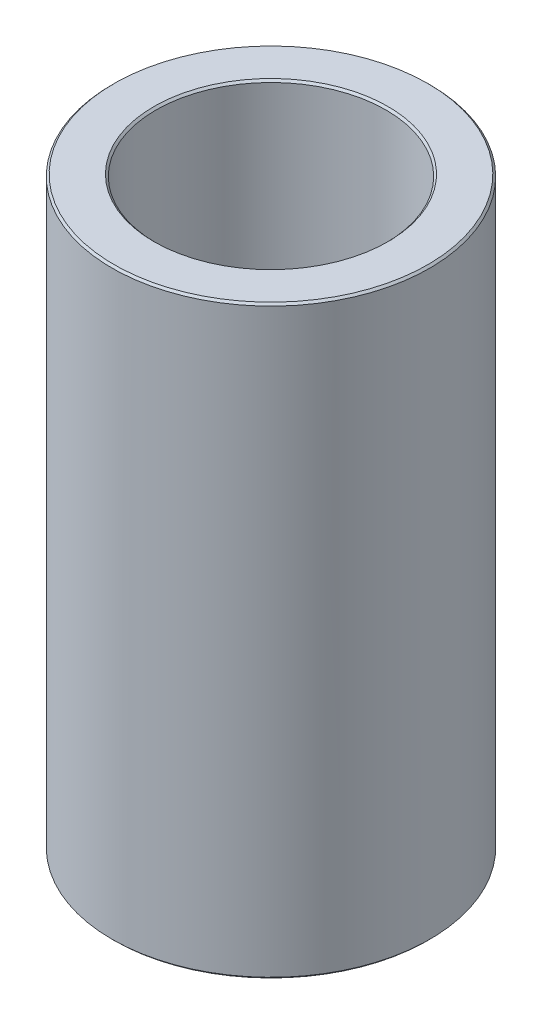
ISO-10303-21;
HEADER;
FILE_DESCRIPTION(('STEP AP214'),'2;1');
FILE_NAME('part.step','',(''),(''),'','','');
FILE_SCHEMA(('AUTOMOTIVE_DESIGN { 1 0 10303 214 1 1 1 1 }'));
ENDSEC;
DATA;
#1=APPLICATION_CONTEXT('core data for automotive mechanical design processes');
#2=APPLICATION_PROTOCOL_DEFINITION('international standard','automotive_design',2000,#1);
#3=PRODUCT_CONTEXT('',#1,'mechanical');
#4=PRODUCT('Part','Part','',(#3));
#5=PRODUCT_RELATED_PRODUCT_CATEGORY('part','',(#4));
#6=PRODUCT_DEFINITION_FORMATION('','',#4);
#7=PRODUCT_DEFINITION_CONTEXT('part definition',#1,'design');
#8=PRODUCT_DEFINITION('design','',#6,#7);
#9=PRODUCT_DEFINITION_SHAPE('','',#8);
#10=(LENGTH_UNIT() NAMED_UNIT(*) SI_UNIT(.MILLI.,.METRE.));
#11=(NAMED_UNIT(*) PLANE_ANGLE_UNIT() SI_UNIT($,.RADIAN.));
#12=(NAMED_UNIT(*) SI_UNIT($,.STERADIAN.) SOLID_ANGLE_UNIT());
#13=UNCERTAINTY_MEASURE_WITH_UNIT(LENGTH_MEASURE(1.E-05),#10,'distance_accuracy_value','');
#14=(GEOMETRIC_REPRESENTATION_CONTEXT(3) GLOBAL_UNCERTAINTY_ASSIGNED_CONTEXT((#13)) GLOBAL_UNIT_ASSIGNED_CONTEXT((#10,
#11,#12)) REPRESENTATION_CONTEXT('',''));
#15=CARTESIAN_POINT('',(0.,0.,0.));
#16=DIRECTION('',(0.,0.,1.));
#17=DIRECTION('',(1.,0.,0.));
#18=AXIS2_PLACEMENT_3D('',#15,#16,#17);
#19=CARTESIAN_POINT('',(0.,211.796028497552,0.));
#20=DIRECTION('',(0.,-1.,0.));
#21=DIRECTION('',(0.,0.,-1.));
#22=AXIS2_PLACEMENT_3D('',#19,#20,#21);
#23=CYLINDRICAL_SURFACE('',#22,57.5);
#24=CARTESIAN_POINT('',(0.,0.728195884436761,0.));
#25=DIRECTION('',(0.,1.,0.));
#26=DIRECTION('',(0.,0.,1.));
#27=AXIS2_PLACEMENT_3D('',#24,#25,#26);
#28=CIRCLE('',#27,57.5);
#29=CARTESIAN_POINT('',(0.,0.728195884436761,57.5));
#30=VERTEX_POINT('',#29);
#31=EDGE_CURVE('E10',#30,#30,#28,.T.);
#32=ORIENTED_EDGE('',*,*,#31,.T.);
#33=EDGE_LOOP('',(#32));
#34=FACE_BOUND('',#33,.T.);
#35=CARTESIAN_POINT('',(0.,211.067832613115,0.));
#36=DIRECTION('',(0.,1.,0.));
#37=DIRECTION('',(0.,0.,1.));
#38=AXIS2_PLACEMENT_3D('',#35,#36,#37);
#39=CIRCLE('',#38,57.5);
#40=CARTESIAN_POINT('',(0.,211.067832613115,-57.5));
#41=VERTEX_POINT('',#40);
#42=EDGE_CURVE('E50',#41,#41,#39,.F.);
#43=ORIENTED_EDGE('',*,*,#42,.T.);
#44=EDGE_LOOP('',(#43));
#45=FACE_BOUND('',#44,.T.);
#46=ADVANCED_FACE('F39',(#34,#45),#23,.T.);
#47=CARTESIAN_POINT('',(0.,211.796028497552,0.));
#48=DIRECTION('',(0.,1.,0.));
#49=DIRECTION('',(0.,0.,1.));
#50=AXIS2_PLACEMENT_3D('',#47,#48,#49);
#51=PLANE('',#50);
#52=CARTESIAN_POINT('',(0.,211.796028497552,0.));
#53=DIRECTION('',(0.,1.,0.));
#54=DIRECTION('',(0.,0.,1.));
#55=AXIS2_PLACEMENT_3D('',#52,#53,#54);
#56=CIRCLE('',#55,42.366535014007);
#57=CARTESIAN_POINT('',(0.,211.796028497552,42.366535014007));
#58=VERTEX_POINT('',#57);
#59=EDGE_CURVE('E58',#58,#58,#56,.F.);
#60=ORIENTED_EDGE('',*,*,#59,.T.);
#61=EDGE_LOOP('',(#60));
#62=FACE_BOUND('',#61,.T.);
#63=CARTESIAN_POINT('',(0.,211.796028497552,0.));
#64=DIRECTION('',(0.,1.,0.));
#65=DIRECTION('',(0.,0.,1.));
#66=AXIS2_PLACEMENT_3D('',#63,#64,#65);
#67=CIRCLE('',#66,56.7718041155632);
#68=CARTESIAN_POINT('',(0.,211.796028497552,-56.7718041155632));
#69=VERTEX_POINT('',#68);
#70=EDGE_CURVE('E61',#69,#69,#67,.T.);
#71=ORIENTED_EDGE('',*,*,#70,.T.);
#72=EDGE_LOOP('',(#71));
#73=FACE_BOUND('',#72,.T.);
#74=ADVANCED_FACE('F88',(#62,#73),#51,.T.);
#75=CARTESIAN_POINT('',(0.,0.,0.));
#76=DIRECTION('',(0.,1.,0.));
#77=DIRECTION('',(0.,0.,1.));
#78=AXIS2_PLACEMENT_3D('',#75,#76,#77);
#79=PLANE('',#78);
#80=CARTESIAN_POINT('',(0.,0.,0.));
#81=DIRECTION('',(0.,1.,0.));
#82=DIRECTION('',(0.,0.,1.));
#83=AXIS2_PLACEMENT_3D('',#80,#81,#82);
#84=CIRCLE('',#83,42.366535014007);
#85=CARTESIAN_POINT('',(0.,0.,-42.366535014007));
#86=VERTEX_POINT('',#85);
#87=EDGE_CURVE('E51',#86,#86,#84,.T.);
#88=ORIENTED_EDGE('',*,*,#87,.T.);
#89=EDGE_LOOP('',(#88));
#90=FACE_BOUND('',#89,.T.);
#91=CARTESIAN_POINT('',(0.,0.,0.));
#92=DIRECTION('',(0.,1.,0.));
#93=DIRECTION('',(0.,0.,1.));
#94=AXIS2_PLACEMENT_3D('',#91,#92,#93);
#95=CIRCLE('',#94,56.7718041155632);
#96=CARTESIAN_POINT('',(0.,0.,56.7718041155632));
#97=VERTEX_POINT('',#96);
#98=EDGE_CURVE('E54',#97,#97,#95,.F.);
#99=ORIENTED_EDGE('',*,*,#98,.T.);
#100=EDGE_LOOP('',(#99));
#101=FACE_BOUND('',#100,.T.);
#102=ADVANCED_FACE('F83',(#90,#101),#79,.F.);
#103=CARTESIAN_POINT('',(0.,211.796028497552,0.));
#104=DIRECTION('',(0.,-1.,0.));
#105=DIRECTION('',(0.,0.,-1.));
#106=AXIS2_PLACEMENT_3D('',#103,#104,#105);
#107=CYLINDRICAL_SURFACE('',#106,41.6383391295702);
#108=CARTESIAN_POINT('',(0.,211.067832613115,0.));
#109=DIRECTION('',(0.,1.,0.));
#110=DIRECTION('',(0.,0.,1.));
#111=AXIS2_PLACEMENT_3D('',#108,#109,#110);
#112=CIRCLE('',#111,41.6383391295702);
#113=CARTESIAN_POINT('',(0.,211.067832613115,-41.6383391295702));
#114=VERTEX_POINT('',#113);
#115=EDGE_CURVE('E67',#114,#114,#112,.T.);
#116=CARTESIAN_POINT('',(0.,0.728195884436816,0.));
#117=DIRECTION('',(0.,1.,0.));
#118=DIRECTION('',(0.,0.,1.));
#119=AXIS2_PLACEMENT_3D('',#116,#117,#118);
#120=CIRCLE('',#119,41.6383391295702);
#121=CARTESIAN_POINT('',(0.,0.728195884436816,-41.6383391295702));
#122=VERTEX_POINT('',#121);
#123=EDGE_CURVE('E69',#122,#122,#120,.F.);
#124=CARTESIAN_POINT('',(0.,211.067832613115,-41.6383391295702));
#125=CARTESIAN_POINT('',(0.,208.876794730524,-41.6383391295702));
#126=CARTESIAN_POINT('',(0.,206.685756847934,-41.6383391295702));
#127=CARTESIAN_POINT('',(0.,202.303681082753,-41.6383391295702));
#128=CARTESIAN_POINT('',(0.,200.112643200163,-41.6383391295702));
#129=CARTESIAN_POINT('',(0.,195.730567434982,-41.6383391295702));
#130=CARTESIAN_POINT('',(0.,193.539529552392,-41.6383391295702));
#131=CARTESIAN_POINT('',(0.,189.157453787211,-41.6383391295702));
#132=CARTESIAN_POINT('',(0.,186.96641590462,-41.6383391295702));
#133=CARTESIAN_POINT('',(0.,182.58434013944,-41.6383391295702));
#134=CARTESIAN_POINT('',(0.,180.393302256849,-41.6383391295702));
#135=CARTESIAN_POINT('',(0.,176.011226491668,-41.6383391295702));
#136=CARTESIAN_POINT('',(0.,173.820188609078,-41.6383391295702));
#137=CARTESIAN_POINT('',(0.,169.438112843897,-41.6383391295702));
#138=CARTESIAN_POINT('',(0.,167.247074961307,-41.6383391295702));
#139=CARTESIAN_POINT('',(0.,162.864999196126,-41.6383391295702));
#140=CARTESIAN_POINT('',(0.,160.673961313536,-41.6383391295702));
#141=CARTESIAN_POINT('',(0.,156.291885548355,-41.6383391295702));
#142=CARTESIAN_POINT('',(0.,154.100847665764,-41.6383391295702));
#143=CARTESIAN_POINT('',(0.,149.718771900584,-41.6383391295702));
#144=CARTESIAN_POINT('',(0.,147.527734017993,-41.6383391295702));
#145=CARTESIAN_POINT('',(0.,143.145658252812,-41.6383391295702));
#146=CARTESIAN_POINT('',(0.,140.954620370222,-41.6383391295702));
#147=CARTESIAN_POINT('',(0.,136.572544605041,-41.6383391295702));
#148=CARTESIAN_POINT('',(0.,134.381506722451,-41.6383391295702));
#149=CARTESIAN_POINT('',(0.,129.99943095727,-41.6383391295702));
#150=CARTESIAN_POINT('',(0.,127.80839307468,-41.6383391295702));
#151=CARTESIAN_POINT('',(0.,123.426317309499,-41.6383391295702));
#152=CARTESIAN_POINT('',(0.,121.235279426909,-41.6383391295702));
#153=CARTESIAN_POINT('',(0.,116.853203661728,-41.6383391295702));
#154=CARTESIAN_POINT('',(0.,114.662165779137,-41.6383391295702));
#155=CARTESIAN_POINT('',(0.,110.280090013957,-41.6383391295702));
#156=CARTESIAN_POINT('',(0.,108.089052131366,-41.6383391295702));
#157=CARTESIAN_POINT('',(0.,103.706976366185,-41.6383391295702));
#158=CARTESIAN_POINT('',(0.,101.515938483595,-41.6383391295702));
#159=CARTESIAN_POINT('',(0.,97.1338627184142,-41.6383391295702));
#160=CARTESIAN_POINT('',(0.,94.9428248358238,-41.6383391295702));
#161=CARTESIAN_POINT('',(0.,90.560749070643,-41.6383391295702));
#162=CARTESIAN_POINT('',(0.,88.3697111880526,-41.6383391295702));
#163=CARTESIAN_POINT('',(0.,83.9876354228718,-41.6383391295702));
#164=CARTESIAN_POINT('',(0.,81.7965975402814,-41.6383391295702));
#165=CARTESIAN_POINT('',(0.,77.4145217751007,-41.6383391295702));
#166=CARTESIAN_POINT('',(0.,75.2234838925103,-41.6383391295702));
#167=CARTESIAN_POINT('',(0.,70.8414081273295,-41.6383391295702));
#168=CARTESIAN_POINT('',(0.,68.6503702447391,-41.6383391295702));
#169=CARTESIAN_POINT('',(0.,64.2682944795583,-41.6383391295702));
#170=CARTESIAN_POINT('',(0.,62.0772565969679,-41.6383391295702));
#171=CARTESIAN_POINT('',(0.,57.6951808317871,-41.6383391295702));
#172=CARTESIAN_POINT('',(0.,55.5041429491967,-41.6383391295702));
#173=CARTESIAN_POINT('',(0.,51.1220671840159,-41.6383391295702));
#174=CARTESIAN_POINT('',(0.,48.9310293014255,-41.6383391295702));
#175=CARTESIAN_POINT('',(0.,44.5489535362447,-41.6383391295702));
#176=CARTESIAN_POINT('',(0.,42.3579156536544,-41.6383391295702));
#177=CARTESIAN_POINT('',(0.,37.9758398884736,-41.6383391295702));
#178=CARTESIAN_POINT('',(0.,35.7848020058832,-41.6383391295702));
#179=CARTESIAN_POINT('',(0.,31.4027262407024,-41.6383391295702));
#180=CARTESIAN_POINT('',(0.,29.211688358112,-41.6383391295702));
#181=CARTESIAN_POINT('',(0.,24.8296125929312,-41.6383391295702));
#182=CARTESIAN_POINT('',(0.,22.6385747103408,-41.6383391295702));
#183=CARTESIAN_POINT('',(0.,18.25649894516,-41.6383391295702));
#184=CARTESIAN_POINT('',(0.,16.0654610625696,-41.6383391295702));
#185=CARTESIAN_POINT('',(0.,11.6833852973888,-41.6383391295702));
#186=CARTESIAN_POINT('',(0.,9.4923474147984,-41.6383391295702));
#187=CARTESIAN_POINT('',(0.,5.11027164961761,-41.6383391295702));
#188=CARTESIAN_POINT('',(0.,2.91923376702721,-41.6383391295702));
#189=CARTESIAN_POINT('',(0.,0.728195884436816,-41.6383391295702));
#190=B_SPLINE_CURVE_WITH_KNOTS('',3,(#124,#125,#126,#127,#128,#129,#130,#131,#132,#133,#134,
#135,#136,#137,#138,#139,#140,#141,#142,#143,#144,#145,#146,#147,#148,#149,#150,#151,#152,#153,
#154,#155,#156,#157,#158,#159,#160,#161,#162,#163,#164,#165,#166,#167,#168,#169,#170,#171,#172,
#173,#174,#175,#176,#177,#178,#179,#180,#181,#182,#183,#184,#185,#186,#187,#188,#189),
.UNSPECIFIED.,.F.,.F.,(4,2,2,2,2,2,2,2,2,2,2,2,2,2,2,2,2,2,2,2,2,2,2,2,2,2,2,2,2,2,2,2,4),(0.,
6.57311364777119,13.1462272955424,19.7193409433136,26.2924545910848,32.8655682388559,
39.4386818866271,46.0117955343983,52.5849091821695,59.1580228299407,65.7311364777119,
72.3042501254831,78.8773637732542,85.4504774210254,92.0235910687966,98.5967047165678,
105.169818364339,111.74293201211,118.316045659881,124.889159307653,131.462272955424,
138.035386603195,144.608500250966,151.181613898737,157.754727546508,164.32784119428,
170.900954842051,177.474068489822,184.047182137593,190.620295785364,197.193409433136,
203.766523080907,210.339636728678),.UNSPECIFIED.);
#191=EDGE_CURVE('BSEAM71',#114,#122,#190,.T.);
#192=ORIENTED_EDGE('',*,*,#115,.T.);
#193=ORIENTED_EDGE('',*,*,#123,.T.);
#194=ORIENTED_EDGE('',*,*,#191,.T.);
#195=ORIENTED_EDGE('',*,*,#191,.F.);
#196=EDGE_LOOP('',(#192,#194,#193,#195));
#197=FACE_BOUND('',#196,.T.);
#198=ADVANCED_FACE('F71',(#197),#107,.F.);
#199=CARTESIAN_POINT('',(0.,211.067832613115,0.));
#200=DIRECTION('',(0.,1.,0.));
#201=DIRECTION('',(0.,0.,1.));
#202=AXIS2_PLACEMENT_3D('',#199,#200,#201);
#203=CONICAL_SURFACE('',#202,41.6383391295702,0.785398163397448);
#204=ORIENTED_EDGE('',*,*,#59,.F.);
#205=EDGE_LOOP('',(#204));
#206=FACE_BOUND('',#205,.T.);
#207=ORIENTED_EDGE('',*,*,#115,.F.);
#208=EDGE_LOOP('',(#207));
#209=FACE_BOUND('',#208,.T.);
#210=ADVANCED_FACE('F77',(#206,#209),#203,.F.);
#211=CARTESIAN_POINT('',(0.,0.,0.));
#212=DIRECTION('',(0.,-1.,0.));
#213=DIRECTION('',(0.,0.,-1.));
#214=AXIS2_PLACEMENT_3D('',#211,#212,#213);
#215=CONICAL_SURFACE('',#214,42.366535014007,0.785398163397448);
#216=CARTESIAN_POINT('',(0.,0.728195884436816,-41.6383391295702));
#217=CARTESIAN_POINT('',(0.,0.720610510640598,-41.6459245033664));
#218=CARTESIAN_POINT('',(0.,0.713025136844381,-41.6535098771626));
#219=CARTESIAN_POINT('',(0.,0.697854389251949,-41.6686806247551));
#220=CARTESIAN_POINT('',(0.,0.690269015455733,-41.6762659985513));
#221=CARTESIAN_POINT('',(0.,0.675098267863299,-41.6914367461437));
#222=CARTESIAN_POINT('',(0.,0.667512894067081,-41.6990221199399));
#223=CARTESIAN_POINT('',(0.,0.652342146474647,-41.7141928675324));
#224=CARTESIAN_POINT('',(0.,0.644756772678431,-41.7217782413286));
#225=CARTESIAN_POINT('',(0.,0.629586025085998,-41.736948988921));
#226=CARTESIAN_POINT('',(0.,0.622000651289781,-41.7445343627172));
#227=CARTESIAN_POINT('',(0.,0.606829903697346,-41.7597051103097));
#228=CARTESIAN_POINT('',(0.,0.599244529901129,-41.7672904841059));
#229=CARTESIAN_POINT('',(0.,0.584073782308696,-41.7824612316983));
#230=CARTESIAN_POINT('',(0.,0.57648840851248,-41.7900466054945));
#231=CARTESIAN_POINT('',(0.,0.561317660920047,-41.805217353087));
#232=CARTESIAN_POINT('',(0.,0.553732287123829,-41.8128027268832));
#233=CARTESIAN_POINT('',(0.,0.538561539531395,-41.8279734744756));
#234=CARTESIAN_POINT('',(0.,0.530976165735178,-41.8355588482718));
#235=CARTESIAN_POINT('',(0.,0.515805418142744,-41.8507295958643));
#236=CARTESIAN_POINT('',(0.,0.508220044346528,-41.8583149696605));
#237=CARTESIAN_POINT('',(0.,0.493049296754095,-41.8734857172529));
#238=CARTESIAN_POINT('',(0.,0.485463922957878,-41.8810710910491));
#239=CARTESIAN_POINT('',(0.,0.470293175365443,-41.8962418386416));
#240=CARTESIAN_POINT('',(0.,0.462707801569226,-41.9038272124378));
#241=CARTESIAN_POINT('',(0.,0.447537053976793,-41.9189979600302));
#242=CARTESIAN_POINT('',(0.,0.439951680180577,-41.9265833338264));
#243=CARTESIAN_POINT('',(0.,0.424780932588143,-41.9417540814189));
#244=CARTESIAN_POINT('',(0.,0.417195558791925,-41.9493394552151));
#245=CARTESIAN_POINT('',(0.,0.402024811199492,-41.9645102028075));
#246=CARTESIAN_POINT('',(0.,0.394439437403276,-41.9720955766037));
#247=CARTESIAN_POINT('',(0.,0.379268689810843,-41.9872663241962));
#248=CARTESIAN_POINT('',(0.,0.371683316014625,-41.9948516979924));
#249=CARTESIAN_POINT('',(0.,0.356512568422191,-42.0100224455848));
#250=CARTESIAN_POINT('',(0.,0.348927194625974,-42.017607819381));
#251=CARTESIAN_POINT('',(0.,0.33375644703354,-42.0327785669735));
#252=CARTESIAN_POINT('',(0.,0.326171073237325,-42.0403639407697));
#253=CARTESIAN_POINT('',(0.,0.311000325644891,-42.0555346883621));
#254=CARTESIAN_POINT('',(0.,0.303414951848673,-42.0631200621583));
#255=CARTESIAN_POINT('',(0.,0.288244204256239,-42.0782908097508));
#256=CARTESIAN_POINT('',(0.,0.280658830460023,-42.085876183547));
#257=CARTESIAN_POINT('',(0.,0.26548808286759,-42.1010469311394));
#258=CARTESIAN_POINT('',(0.,0.257902709071373,-42.1086323049356));
#259=CARTESIAN_POINT('',(0.,0.242731961478938,-42.1238030525281));
#260=CARTESIAN_POINT('',(0.,0.235146587682721,-42.1313884263243));
#261=CARTESIAN_POINT('',(0.,0.219975840090288,-42.1465591739167));
#262=CARTESIAN_POINT('',(0.,0.212390466294072,-42.1541445477129));
#263=CARTESIAN_POINT('',(0.,0.197219718701639,-42.1693152953054));
#264=CARTESIAN_POINT('',(0.,0.189634344905421,-42.1769006691016));
#265=CARTESIAN_POINT('',(0.,0.174463597312987,-42.192071416694));
#266=CARTESIAN_POINT('',(0.,0.16687822351677,-42.1996567904902));
#267=CARTESIAN_POINT('',(0.,0.151707475924336,-42.2148275380827));
#268=CARTESIAN_POINT('',(0.,0.14412210212812,-42.2224129118789));
#269=CARTESIAN_POINT('',(0.,0.128951354535687,-42.2375836594713));
#270=CARTESIAN_POINT('',(0.,0.12136598073947,-42.2451690332675));
#271=CARTESIAN_POINT('',(0.,0.106195233147035,-42.26033978086));
#272=CARTESIAN_POINT('',(0.,0.098609859350818,-42.2679251546562));
#273=CARTESIAN_POINT('',(0.,0.0834391117583849,-42.2830959022486));
#274=CARTESIAN_POINT('',(0.,0.075853737962169,-42.2906812760448));
#275=CARTESIAN_POINT('',(0.,0.0606829903697352,-42.3058520236373));
#276=CARTESIAN_POINT('',(0.,0.0530976165735174,-42.3134373974335));
#277=CARTESIAN_POINT('',(0.,0.0379268689810834,-42.3286081450259));
#278=CARTESIAN_POINT('',(0.,0.0303414951848673,-42.3361935188221));
#279=CARTESIAN_POINT('',(0.,0.0151707475924349,-42.3513642664146));
#280=CARTESIAN_POINT('',(0.,0.00758537379621872,-42.3589496402108));
#281=CARTESIAN_POINT('',(0.,0.,-42.366535014007));
#282=B_SPLINE_CURVE_WITH_KNOTS('',3,(#216,#217,#218,#219,#220,#221,#222,#223,#224,#225,#226,
#227,#228,#229,#230,#231,#232,#233,#234,#235,#236,#237,#238,#239,#240,#241,#242,#243,#244,#245,
#246,#247,#248,#249,#250,#251,#252,#253,#254,#255,#256,#257,#258,#259,#260,#261,#262,#263,#264,
#265,#266,#267,#268,#269,#270,#271,#272,#273,#274,#275,#276,#277,#278,#279,#280,#281),
.UNSPECIFIED.,.F.,.F.,(4,2,2,2,2,2,2,2,2,2,2,2,2,2,2,2,2,2,2,2,2,2,2,2,2,2,2,2,2,2,2,2,4),(0.,
0.0321820154948362,0.0643640309896773,0.0965460464845135,0.128728061979355,0.160910077474191,
0.193092092969027,0.225274108463868,0.257456123958704,0.28963813945354,0.321820154948381,
0.354002170443218,0.386184185938054,0.418366201432895,0.450548216927731,0.482730232422572,
0.514912247917408,0.547094263412245,0.579276278907086,0.611458294401922,0.643640309896763,
0.675822325391599,0.708004340886435,0.740186356381276,0.772368371876112,0.804550387370949,
0.83673240286579,0.868914418360626,0.901096433855462,0.933278449350303,0.965460464845139,
0.99764248033998,1.02982449583482),.UNSPECIFIED.);
#283=EDGE_CURVE('BSEAM73',#122,#86,#282,.T.);
#284=ORIENTED_EDGE('',*,*,#123,.F.);
#285=ORIENTED_EDGE('',*,*,#87,.F.);
#286=ORIENTED_EDGE('',*,*,#283,.T.);
#287=ORIENTED_EDGE('',*,*,#283,.F.);
#288=EDGE_LOOP('',(#284,#286,#285,#287));
#289=FACE_BOUND('',#288,.T.);
#290=ADVANCED_FACE('F73',(#289),#215,.F.);
#291=CARTESIAN_POINT('',(0.,0.728195884436761,0.));
#292=DIRECTION('',(0.,1.,0.));
#293=DIRECTION('',(0.,0.,1.));
#294=AXIS2_PLACEMENT_3D('',#291,#292,#293);
#295=CONICAL_SURFACE('',#294,57.5,0.785398163397448);
#296=ORIENTED_EDGE('',*,*,#98,.F.);
#297=EDGE_LOOP('',(#296));
#298=FACE_BOUND('',#297,.T.);
#299=ORIENTED_EDGE('',*,*,#31,.F.);
#300=EDGE_LOOP('',(#299));
#301=FACE_BOUND('',#300,.T.);
#302=ADVANCED_FACE('F76',(#298,#301),#295,.T.);
#303=CARTESIAN_POINT('',(0.,211.796028497552,0.));
#304=DIRECTION('',(0.,-1.,0.));
#305=DIRECTION('',(0.,0.,-1.));
#306=AXIS2_PLACEMENT_3D('',#303,#304,#305);
#307=CONICAL_SURFACE('',#306,56.7718041155632,0.785398163397439);
#308=CARTESIAN_POINT('',(0.,211.067832613115,-57.5));
#309=CARTESIAN_POINT('',(0.,211.075417986911,-57.4924146262038));
#310=CARTESIAN_POINT('',(0.,211.083003360707,-57.4848292524076));
#311=CARTESIAN_POINT('',(0.,211.0981741083,-57.4696585048152));
#312=CARTESIAN_POINT('',(0.,211.105759482096,-57.4620731310189));
#313=CARTESIAN_POINT('',(0.,211.120930229688,-57.4469023834265));
#314=CARTESIAN_POINT('',(0.,211.128515603484,-57.4393170096303));
#315=CARTESIAN_POINT('',(0.,211.143686351077,-57.4241462620378));
#316=CARTESIAN_POINT('',(0.,211.151271724873,-57.4165608882416));
#317=CARTESIAN_POINT('',(0.,211.166442472466,-57.4013901406492));
#318=CARTESIAN_POINT('',(0.,211.174027846262,-57.393804766853));
#319=CARTESIAN_POINT('',(0.,211.189198593854,-57.3786340192605));
#320=CARTESIAN_POINT('',(0.,211.19678396765,-57.3710486454643));
#321=CARTESIAN_POINT('',(0.,211.211954715243,-57.3558778978719));
#322=CARTESIAN_POINT('',(0.,211.219540089039,-57.3482925240757));
#323=CARTESIAN_POINT('',(0.,211.234710836632,-57.3331217764833));
#324=CARTESIAN_POINT('',(0.,211.242296210428,-57.325536402687));
#325=CARTESIAN_POINT('',(0.,211.25746695802,-57.3103656550946));
#326=CARTESIAN_POINT('',(0.,211.265052331816,-57.3027802812984));
#327=CARTESIAN_POINT('',(0.,211.280223079409,-57.287609533706));
#328=CARTESIAN_POINT('',(0.,211.287808453205,-57.2800241599097));
#329=CARTESIAN_POINT('',(0.,211.302979200797,-57.2648534123173));
#330=CARTESIAN_POINT('',(0.,211.310564574594,-57.2572680385211));
#331=CARTESIAN_POINT('',(0.,211.325735322186,-57.2420972909287));
#332=CARTESIAN_POINT('',(0.,211.333320695982,-57.2345119171324));
#333=CARTESIAN_POINT('',(0.,211.348491443575,-57.21934116954));
#334=CARTESIAN_POINT('',(0.,211.356076817371,-57.2117557957438));
#335=CARTESIAN_POINT('',(0.,211.371247564963,-57.1965850481513));
#336=CARTESIAN_POINT('',(0.,211.37883293876,-57.1889996743551));
#337=CARTESIAN_POINT('',(0.,211.394003686352,-57.1738289267627));
#338=CARTESIAN_POINT('',(0.,211.401589060148,-57.1662435529665));
#339=CARTESIAN_POINT('',(0.,211.416759807741,-57.151072805374));
#340=CARTESIAN_POINT('',(0.,211.424345181537,-57.1434874315778));
#341=CARTESIAN_POINT('',(0.,211.439515929129,-57.1283166839854));
#342=CARTESIAN_POINT('',(0.,211.447101302926,-57.1207313101892));
#343=CARTESIAN_POINT('',(0.,211.462272050518,-57.1055605625968));
#344=CARTESIAN_POINT('',(0.,211.469857424314,-57.0979751888005));
#345=CARTESIAN_POINT('',(0.,211.485028171907,-57.0828044412081));
#346=CARTESIAN_POINT('',(0.,211.492613545703,-57.0752190674119));
#347=CARTESIAN_POINT('',(0.,211.507784293295,-57.0600483198195));
#348=CARTESIAN_POINT('',(0.,211.515369667092,-57.0524629460232));
#349=CARTESIAN_POINT('',(0.,211.530540414684,-57.0372921984308));
#350=CARTESIAN_POINT('',(0.,211.53812578848,-57.0297068246346));
#351=CARTESIAN_POINT('',(0.,211.553296536073,-57.0145360770421));
#352=CARTESIAN_POINT('',(0.,211.560881909869,-57.0069507032459));
#353=CARTESIAN_POINT('',(0.,211.576052657461,-56.9917799556535));
#354=CARTESIAN_POINT('',(0.,211.583638031258,-56.9841945818573));
#355=CARTESIAN_POINT('',(0.,211.59880877885,-56.9690238342648));
#356=CARTESIAN_POINT('',(0.,211.606394152646,-56.9614384604686));
#357=CARTESIAN_POINT('',(0.,211.621564900239,-56.9462677128762));
#358=CARTESIAN_POINT('',(0.,211.629150274035,-56.93868233908));
#359=CARTESIAN_POINT('',(0.,211.644321021627,-56.9235115914875));
#360=CARTESIAN_POINT('',(0.,211.651906395423,-56.9159262176913));
#361=CARTESIAN_POINT('',(0.,211.667077143016,-56.9007554700989));
#362=CARTESIAN_POINT('',(0.,211.674662516812,-56.8931700963027));
#363=CARTESIAN_POINT('',(0.,211.689833264405,-56.8779993487103));
#364=CARTESIAN_POINT('',(0.,211.697418638201,-56.870413974914));
#365=CARTESIAN_POINT('',(0.,211.712589385793,-56.8552432273216));
#366=CARTESIAN_POINT('',(0.,211.720174759589,-56.8476578535254));
#367=CARTESIAN_POINT('',(0.,211.735345507182,-56.8324871059329));
#368=CARTESIAN_POINT('',(0.,211.742930880978,-56.8249017321367));
#369=CARTESIAN_POINT('',(0.,211.758101628571,-56.8097309845443));
#370=CARTESIAN_POINT('',(0.,211.765687002367,-56.8021456107481));
#371=CARTESIAN_POINT('',(0.,211.780857749959,-56.7869748631556));
#372=CARTESIAN_POINT('',(0.,211.788443123755,-56.7793894893594));
#373=CARTESIAN_POINT('',(0.,211.796028497552,-56.7718041155632));
#374=B_SPLINE_CURVE_WITH_KNOTS('',3,(#308,#309,#310,#311,#312,#313,#314,#315,#316,#317,#318,
#319,#320,#321,#322,#323,#324,#325,#326,#327,#328,#329,#330,#331,#332,#333,#334,#335,#336,#337,
#338,#339,#340,#341,#342,#343,#344,#345,#346,#347,#348,#349,#350,#351,#352,#353,#354,#355,#356,
#357,#358,#359,#360,#361,#362,#363,#364,#365,#366,#367,#368,#369,#370,#371,#372,#373),
.UNSPECIFIED.,.F.,.F.,(4,2,2,2,2,2,2,2,2,2,2,2,2,2,2,2,2,2,2,2,2,2,2,2,2,2,2,2,2,2,2,2,4),(0.,
0.0321820154948442,0.0643640309896932,0.0965460464845177,0.128728061979362,0.160910077474191,
0.193092092969036,0.22527410846388,0.257456123958704,0.289638139453553,0.321820154948378,
0.354002170443222,0.386184185938071,0.418366201432895,0.45054821692774,0.482730232422569,
0.514912247917413,0.547094263412257,0.579276278907087,0.611458294401931,0.643640309896756,
0.675822325391605,0.708004340886449,0.740186356381273,0.772368371876118,0.804550387370947,
0.836732402865791,0.868914418360635,0.901096433855465,0.933278449350309,0.965460464845134,
0.997642480339983,1.02982449583483),.UNSPECIFIED.);
#375=EDGE_CURVE('BSEAM45',#41,#69,#374,.T.);
#376=ORIENTED_EDGE('',*,*,#42,.F.);
#377=ORIENTED_EDGE('',*,*,#70,.F.);
#378=ORIENTED_EDGE('',*,*,#375,.T.);
#379=ORIENTED_EDGE('',*,*,#375,.F.);
#380=EDGE_LOOP('',(#376,#378,#377,#379));
#381=FACE_BOUND('',#380,.T.);
#382=ADVANCED_FACE('F45',(#381),#307,.T.);
#383=CLOSED_SHELL('',(#46,#74,#102,#198,#210,#290,#302,#382));
#384=MANIFOLD_SOLID_BREP('B2',#383);
#385=ADVANCED_BREP_SHAPE_REPRESENTATION('',(#18,#384),#14);
#386=SHAPE_DEFINITION_REPRESENTATION(#9,#385);
ENDSEC;
END-ISO-10303-21;
